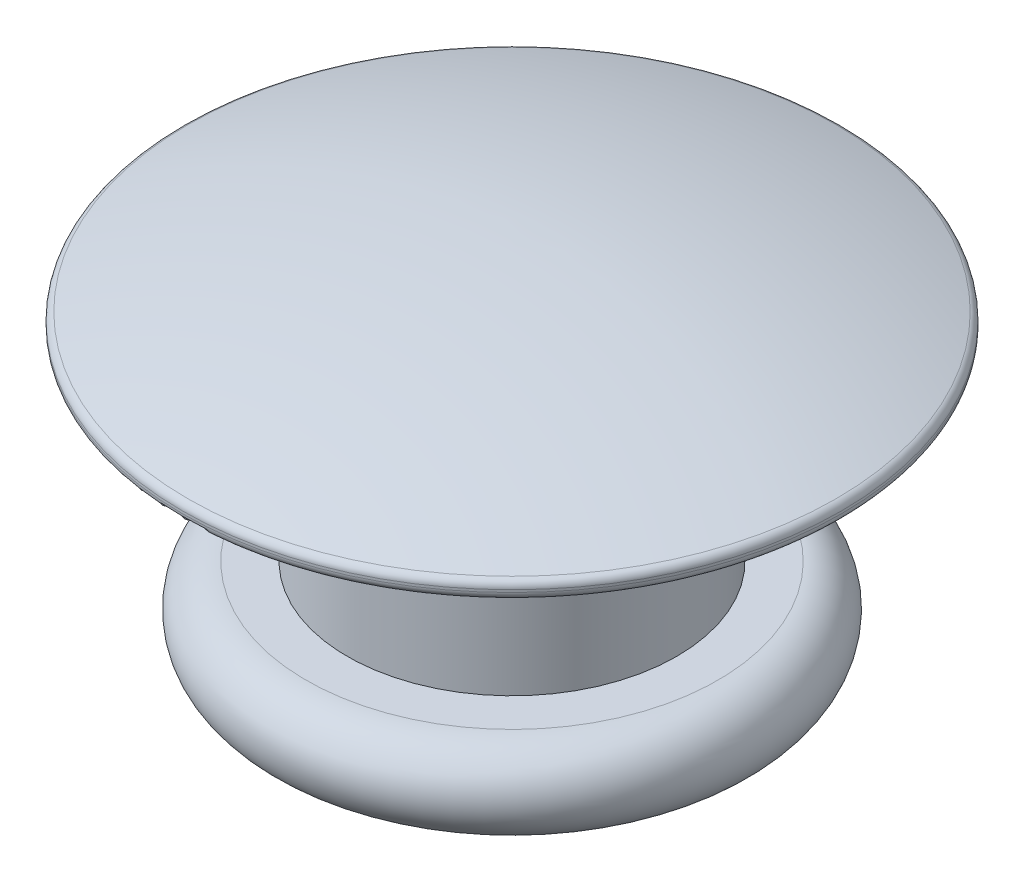
ISO-10303-21;
HEADER;
FILE_DESCRIPTION(('STEP AP214'),'2;1');
FILE_NAME('part.step','',(''),(''),'','','');
FILE_SCHEMA(('AUTOMOTIVE_DESIGN { 1 0 10303 214 1 1 1 1 }'));
ENDSEC;
DATA;
#1=APPLICATION_CONTEXT('core data for automotive mechanical design processes');
#2=APPLICATION_PROTOCOL_DEFINITION('international standard','automotive_design',2000,#1);
#3=PRODUCT_CONTEXT('',#1,'mechanical');
#4=PRODUCT('Part','Part','',(#3));
#5=PRODUCT_RELATED_PRODUCT_CATEGORY('part','',(#4));
#6=PRODUCT_DEFINITION_FORMATION('','',#4);
#7=PRODUCT_DEFINITION_CONTEXT('part definition',#1,'design');
#8=PRODUCT_DEFINITION('design','',#6,#7);
#9=PRODUCT_DEFINITION_SHAPE('','',#8);
#10=(LENGTH_UNIT() NAMED_UNIT(*) SI_UNIT(.MILLI.,.METRE.));
#11=(NAMED_UNIT(*) PLANE_ANGLE_UNIT() SI_UNIT($,.RADIAN.));
#12=(NAMED_UNIT(*) SI_UNIT($,.STERADIAN.) SOLID_ANGLE_UNIT());
#13=UNCERTAINTY_MEASURE_WITH_UNIT(LENGTH_MEASURE(1.E-05),#10,'distance_accuracy_value','');
#14=(GEOMETRIC_REPRESENTATION_CONTEXT(3) GLOBAL_UNCERTAINTY_ASSIGNED_CONTEXT((#13)) GLOBAL_UNIT_ASSIGNED_CONTEXT((#10,
#11,#12)) REPRESENTATION_CONTEXT('',''));
#15=CARTESIAN_POINT('',(0.,0.,0.));
#16=DIRECTION('',(0.,0.,1.));
#17=DIRECTION('',(1.,0.,0.));
#18=AXIS2_PLACEMENT_3D('',#15,#16,#17);
#19=CARTESIAN_POINT('',(0.,-10.8785714285715,0.));
#20=DIRECTION('',(0.,1.,0.));
#21=DIRECTION('',(1.,0.,0.));
#22=AXIS2_PLACEMENT_3D('',#19,#20,#21);
#23=SPHERICAL_SURFACE('',#22,11.7785714285715);
#24=CARTESIAN_POINT('',(0.,0.223822576390524,0.));
#25=DIRECTION('',(0.,1.,0.));
#26=DIRECTION('',(-1.,0.,0.));
#27=AXIS2_PLACEMENT_3D('',#24,#25,#26);
#28=CIRCLE('',#27,3.93339449541284);
#29=CARTESIAN_POINT('',(-3.93339449541284,0.223822576390523,0.));
#30=VERTEX_POINT('',#29);
#31=EDGE_CURVE('E10',#30,#30,#28,.T.);
#32=ORIENTED_EDGE('',*,*,#31,.T.);
#33=EDGE_LOOP('',(#32));
#34=FACE_BOUND('',#33,.T.);
#35=ADVANCED_FACE('F34',(#34),#23,.T.);
#36=CARTESIAN_POINT('',(0.,0.129563318616439,0.));
#37=DIRECTION('',(0.,1.,0.));
#38=DIRECTION('',(-1.,0.,0.));
#39=AXIS2_PLACEMENT_3D('',#36,#37,#38);
#40=TOROIDAL_SURFACE('',#39,3.9,0.0999999999999994);
#41=ORIENTED_EDGE('',*,*,#31,.F.);
#42=EDGE_LOOP('',(#41));
#43=FACE_BOUND('',#42,.T.);
#44=CARTESIAN_POINT('',(0.,0.12956331861644,0.));
#45=DIRECTION('',(0.,1.,0.));
#46=DIRECTION('',(-1.,0.,0.));
#47=AXIS2_PLACEMENT_3D('',#44,#45,#46);
#48=CIRCLE('',#47,4.);
#49=CARTESIAN_POINT('',(-4.,0.12956331861644,0.));
#50=VERTEX_POINT('',#49);
#51=EDGE_CURVE('E41',#50,#50,#48,.T.);
#52=ORIENTED_EDGE('',*,*,#51,.T.);
#53=EDGE_LOOP('',(#52));
#54=FACE_BOUND('',#53,.T.);
#55=ADVANCED_FACE('F94',(#43,#54),#40,.T.);
#56=CARTESIAN_POINT('',(0.,0.,0.));
#57=DIRECTION('',(0.,1.,0.));
#58=DIRECTION('',(-1.,0.,0.));
#59=AXIS2_PLACEMENT_3D('',#56,#57,#58);
#60=CYLINDRICAL_SURFACE('',#59,4.);
#61=ORIENTED_EDGE('',*,*,#51,.F.);
#62=EDGE_LOOP('',(#61));
#63=FACE_BOUND('',#62,.T.);
#64=CARTESIAN_POINT('',(0.,0.0999999999999965,0.));
#65=DIRECTION('',(0.,1.,0.));
#66=DIRECTION('',(-1.,0.,0.));
#67=AXIS2_PLACEMENT_3D('',#64,#65,#66);
#68=CIRCLE('',#67,4.);
#69=CARTESIAN_POINT('',(-4.,0.0999999999999959,0.));
#70=VERTEX_POINT('',#69);
#71=EDGE_CURVE('E48',#70,#70,#68,.T.);
#72=ORIENTED_EDGE('',*,*,#71,.T.);
#73=EDGE_LOOP('',(#72));
#74=FACE_BOUND('',#73,.T.);
#75=ADVANCED_FACE('F98',(#63,#74),#60,.T.);
#76=CARTESIAN_POINT('',(0.,0.0999999999999938,0.));
#77=DIRECTION('',(0.,1.,0.));
#78=DIRECTION('',(-1.,0.,0.));
#79=AXIS2_PLACEMENT_3D('',#76,#77,#78);
#80=TOROIDAL_SURFACE('',#79,3.9,0.1);
#81=ORIENTED_EDGE('',*,*,#71,.F.);
#82=EDGE_LOOP('',(#81));
#83=FACE_BOUND('',#82,.T.);
#84=CARTESIAN_POINT('',(0.,0.,0.));
#85=DIRECTION('',(0.,1.,0.));
#86=DIRECTION('',(-1.,0.,0.));
#87=AXIS2_PLACEMENT_3D('',#84,#85,#86);
#88=CIRCLE('',#87,3.9);
#89=CARTESIAN_POINT('',(-3.9,0.,0.));
#90=VERTEX_POINT('',#89);
#91=EDGE_CURVE('E53',#90,#90,#88,.T.);
#92=ORIENTED_EDGE('',*,*,#91,.T.);
#93=EDGE_LOOP('',(#92));
#94=FACE_BOUND('',#93,.T.);
#95=ADVANCED_FACE('F103',(#83,#94),#80,.T.);
#96=CARTESIAN_POINT('',(3.9,0.,0.));
#97=DIRECTION('',(0.,1.,0.));
#98=DIRECTION('',(-1.,0.,0.));
#99=AXIS2_PLACEMENT_3D('',#96,#97,#98);
#100=PLANE('',#99);
#101=ORIENTED_EDGE('',*,*,#91,.F.);
#102=EDGE_LOOP('',(#101));
#103=FACE_BOUND('',#102,.T.);
#104=CARTESIAN_POINT('',(0.,0.,0.));
#105=DIRECTION('',(0.,1.,0.));
#106=DIRECTION('',(-1.,0.,0.));
#107=AXIS2_PLACEMENT_3D('',#104,#105,#106);
#108=CIRCLE('',#107,2.);
#109=CARTESIAN_POINT('',(-2.,0.,0.));
#110=VERTEX_POINT('',#109);
#111=EDGE_CURVE('E59',#110,#110,#108,.T.);
#112=ORIENTED_EDGE('',*,*,#111,.T.);
#113=EDGE_LOOP('',(#112));
#114=FACE_BOUND('',#113,.T.);
#115=ADVANCED_FACE('F109',(#103,#114),#100,.F.);
#116=CARTESIAN_POINT('',(0.,0.,0.));
#117=DIRECTION('',(0.,1.,0.));
#118=DIRECTION('',(-1.,0.,0.));
#119=AXIS2_PLACEMENT_3D('',#116,#117,#118);
#120=CYLINDRICAL_SURFACE('',#119,2.);
#121=ORIENTED_EDGE('',*,*,#111,.F.);
#122=EDGE_LOOP('',(#121));
#123=FACE_BOUND('',#122,.T.);
#124=CARTESIAN_POINT('',(0.,-2.40000000000001,0.));
#125=DIRECTION('',(0.,1.,0.));
#126=DIRECTION('',(-1.,0.,0.));
#127=AXIS2_PLACEMENT_3D('',#124,#125,#126);
#128=CIRCLE('',#127,2.);
#129=CARTESIAN_POINT('',(-2.,-2.40000000000001,0.));
#130=VERTEX_POINT('',#129);
#131=EDGE_CURVE('E63',#130,#130,#128,.T.);
#132=ORIENTED_EDGE('',*,*,#131,.T.);
#133=EDGE_LOOP('',(#132));
#134=FACE_BOUND('',#133,.T.);
#135=ADVANCED_FACE('F113',(#123,#134),#120,.T.);
#136=CARTESIAN_POINT('',(2.,-2.4,0.));
#137=DIRECTION('',(0.,-1.,0.));
#138=DIRECTION('',(1.,0.,0.));
#139=AXIS2_PLACEMENT_3D('',#136,#137,#138);
#140=PLANE('',#139);
#141=ORIENTED_EDGE('',*,*,#131,.F.);
#142=EDGE_LOOP('',(#141));
#143=FACE_BOUND('',#142,.T.);
#144=CARTESIAN_POINT('',(0.,-2.4,0.));
#145=DIRECTION('',(0.,1.,0.));
#146=DIRECTION('',(-1.,0.,0.));
#147=AXIS2_PLACEMENT_3D('',#144,#145,#146);
#148=CIRCLE('',#147,2.5);
#149=CARTESIAN_POINT('',(-2.5,-2.4,0.));
#150=VERTEX_POINT('',#149);
#151=EDGE_CURVE('E66',#150,#150,#148,.T.);
#152=ORIENTED_EDGE('',*,*,#151,.T.);
#153=EDGE_LOOP('',(#152));
#154=FACE_BOUND('',#153,.T.);
#155=ADVANCED_FACE('F117',(#143,#154),#140,.F.);
#156=CARTESIAN_POINT('',(0.,-2.9,0.));
#157=DIRECTION('',(0.,1.,0.));
#158=DIRECTION('',(-1.,0.,0.));
#159=AXIS2_PLACEMENT_3D('',#156,#157,#158);
#160=TOROIDAL_SURFACE('',#159,2.5,0.500000000000001);
#161=ORIENTED_EDGE('',*,*,#151,.F.);
#162=EDGE_LOOP('',(#161));
#163=FACE_BOUND('',#162,.T.);
#164=CARTESIAN_POINT('',(0.,-3.4,0.));
#165=DIRECTION('',(0.,1.,0.));
#166=DIRECTION('',(-1.,0.,0.));
#167=AXIS2_PLACEMENT_3D('',#164,#165,#166);
#168=CIRCLE('',#167,2.5);
#169=CARTESIAN_POINT('',(-2.5,-3.4,0.));
#170=VERTEX_POINT('',#169);
#171=EDGE_CURVE('E70',#170,#170,#168,.T.);
#172=ORIENTED_EDGE('',*,*,#171,.T.);
#173=EDGE_LOOP('',(#172));
#174=FACE_BOUND('',#173,.T.);
#175=ADVANCED_FACE('F121',(#163,#174),#160,.T.);
#176=CARTESIAN_POINT('',(2.5,-3.4,0.));
#177=DIRECTION('',(0.,1.,0.));
#178=DIRECTION('',(-1.,0.,0.));
#179=AXIS2_PLACEMENT_3D('',#176,#177,#178);
#180=PLANE('',#179);
#181=ORIENTED_EDGE('',*,*,#171,.F.);
#182=EDGE_LOOP('',(#181));
#183=FACE_BOUND('',#182,.T.);
#184=CARTESIAN_POINT('',(0.,-3.4,0.));
#185=DIRECTION('',(0.,1.,0.));
#186=DIRECTION('',(-1.,0.,0.));
#187=AXIS2_PLACEMENT_3D('',#184,#185,#186);
#188=CIRCLE('',#187,1.9);
#189=CARTESIAN_POINT('',(-1.9,-3.4,0.));
#190=VERTEX_POINT('',#189);
#191=EDGE_CURVE('E74',#190,#190,#188,.T.);
#192=ORIENTED_EDGE('',*,*,#191,.T.);
#193=EDGE_LOOP('',(#192));
#194=FACE_BOUND('',#193,.T.);
#195=ADVANCED_FACE('F90',(#183,#194),#180,.F.);
#196=CARTESIAN_POINT('',(0.,-2.9,0.));
#197=DIRECTION('',(0.,1.,0.));
#198=DIRECTION('',(-1.,0.,0.));
#199=AXIS2_PLACEMENT_3D('',#196,#197,#198);
#200=TOROIDAL_SURFACE('',#199,1.9,0.499999999999999);
#201=ORIENTED_EDGE('',*,*,#191,.F.);
#202=EDGE_LOOP('',(#201));
#203=FACE_BOUND('',#202,.T.);
#204=CARTESIAN_POINT('',(0.,-2.9,0.));
#205=DIRECTION('',(0.,1.,0.));
#206=DIRECTION('',(-1.,0.,0.));
#207=AXIS2_PLACEMENT_3D('',#204,#205,#206);
#208=CIRCLE('',#207,1.4);
#209=CARTESIAN_POINT('',(-1.4,-2.9,0.));
#210=VERTEX_POINT('',#209);
#211=EDGE_CURVE('E78',#210,#210,#208,.T.);
#212=ORIENTED_EDGE('',*,*,#211,.T.);
#213=EDGE_LOOP('',(#212));
#214=FACE_BOUND('',#213,.T.);
#215=ADVANCED_FACE('F82',(#203,#214),#200,.T.);
#216=CARTESIAN_POINT('',(1.4,-2.9,0.));
#217=DIRECTION('',(0.,1.,0.));
#218=DIRECTION('',(-1.,0.,0.));
#219=AXIS2_PLACEMENT_3D('',#216,#217,#218);
#220=PLANE('',#219);
#221=ORIENTED_EDGE('',*,*,#211,.F.);
#222=EDGE_LOOP('',(#221));
#223=FACE_BOUND('',#222,.T.);
#224=ADVANCED_FACE('F84',(#223),#220,.F.);
#225=CLOSED_SHELL('',(#35,#55,#75,#95,#115,#135,#155,#175,#195,#215,#224));
#226=MANIFOLD_SOLID_BREP('B2',#225);
#227=ADVANCED_BREP_SHAPE_REPRESENTATION('',(#18,#226),#14);
#228=SHAPE_DEFINITION_REPRESENTATION(#9,#227);
ENDSEC;
END-ISO-10303-21;
